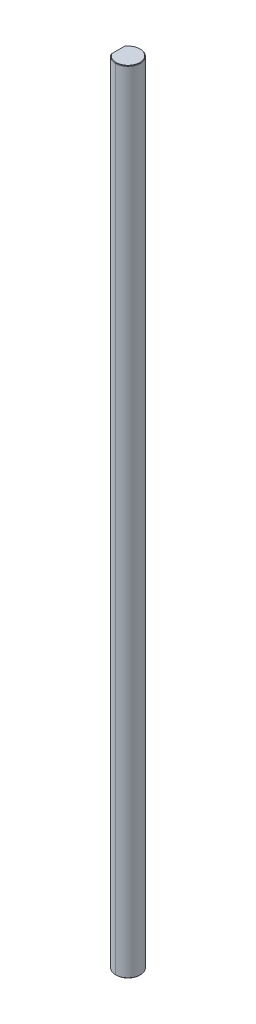
ISO-10303-21;
HEADER;
FILE_DESCRIPTION(('STEP AP214'),'2;1');
FILE_NAME('part.step','',(''),(''),'','','');
FILE_SCHEMA(('AUTOMOTIVE_DESIGN { 1 0 10303 214 1 1 1 1 }'));
ENDSEC;
DATA;
#1=APPLICATION_CONTEXT('core data for automotive mechanical design processes');
#2=APPLICATION_PROTOCOL_DEFINITION('international standard','automotive_design',2000,#1);
#3=PRODUCT_CONTEXT('',#1,'mechanical');
#4=PRODUCT('Part','Part','',(#3));
#5=PRODUCT_RELATED_PRODUCT_CATEGORY('part','',(#4));
#6=PRODUCT_DEFINITION_FORMATION('','',#4);
#7=PRODUCT_DEFINITION_CONTEXT('part definition',#1,'design');
#8=PRODUCT_DEFINITION('design','',#6,#7);
#9=PRODUCT_DEFINITION_SHAPE('','',#8);
#10=(LENGTH_UNIT() NAMED_UNIT(*) SI_UNIT(.MILLI.,.METRE.));
#11=(NAMED_UNIT(*) PLANE_ANGLE_UNIT() SI_UNIT($,.RADIAN.));
#12=(NAMED_UNIT(*) SI_UNIT($,.STERADIAN.) SOLID_ANGLE_UNIT());
#13=UNCERTAINTY_MEASURE_WITH_UNIT(LENGTH_MEASURE(1.E-05),#10,'distance_accuracy_value','');
#14=(GEOMETRIC_REPRESENTATION_CONTEXT(3) GLOBAL_UNCERTAINTY_ASSIGNED_CONTEXT((#13)) GLOBAL_UNIT_ASSIGNED_CONTEXT((#10,
#11,#12)) REPRESENTATION_CONTEXT('',''));
#15=CARTESIAN_POINT('',(0.,0.,0.));
#16=DIRECTION('',(0.,0.,1.));
#17=DIRECTION('',(1.,0.,0.));
#18=AXIS2_PLACEMENT_3D('',#15,#16,#17);
#19=CARTESIAN_POINT('',(0.,203.2,0.));
#20=DIRECTION('',(0.,-1.,0.));
#21=DIRECTION('',(0.,0.,-1.));
#22=AXIS2_PLACEMENT_3D('',#19,#20,#21);
#23=CONICAL_SURFACE('',#22,3.04419,0.785398163397484);
#24=DIRECTION('',(0.,-0.707106781186522,0.707106781186573));
#25=VECTOR('',#24,1.);
#26=CARTESIAN_POINT('',(0.,203.2,3.04419));
#27=LINE('',#26,#25);
#28=CARTESIAN_POINT('',(0.,203.2,3.04419));
#29=VERTEX_POINT('',#28);
#30=CARTESIAN_POINT('',(0.,203.073,3.17119));
#31=VERTEX_POINT('',#30);
#32=EDGE_CURVE('E166',#29,#31,#27,.T.);
#33=ORIENTED_EDGE('',*,*,#32,.F.);
#34=CARTESIAN_POINT('',(0.,203.2,0.));
#35=DIRECTION('',(0.,1.,0.));
#36=DIRECTION('',(0.,0.,1.));
#37=AXIS2_PLACEMENT_3D('',#34,#35,#36);
#38=CIRCLE('',#37,3.04419);
#39=CARTESIAN_POINT('',(-2.54381,203.2,1.67216130800824));
#40=VERTEX_POINT('',#39);
#41=EDGE_CURVE('E29',#40,#29,#38,.T.);
#42=ORIENTED_EDGE('',*,*,#41,.F.);
#43=CARTESIAN_POINT('',(-2.54381,203.073,1.89353550270387));
#44=CARTESIAN_POINT('',(-2.54381,203.116613746444,1.82049357854219));
#45=CARTESIAN_POINT('',(-2.54381,203.159042414268,1.74672509100728));
#46=CARTESIAN_POINT('',(-2.54381,203.2,1.67216130800824));
#47=(BOUNDED_CURVE() B_SPLINE_CURVE(3,(#43,#44,#45,#46),.UNSPECIFIED.,.F.,
.F.) B_SPLINE_CURVE_WITH_KNOTS((4,4),(0.,0.000255216641458076),
.UNSPECIFIED.) CURVE() GEOMETRIC_REPRESENTATION_ITEM() RATIONAL_B_SPLINE_CURVE((1.,1.,1.,1.)) REPRESENTATION_ITEM(''));
#48=CARTESIAN_POINT('',(-2.54381,203.073,1.89353550270387));
#49=VERTEX_POINT('',#48);
#50=EDGE_CURVE('E193',#49,#40,#47,.T.);
#51=ORIENTED_EDGE('',*,*,#50,.F.);
#52=CARTESIAN_POINT('',(0.,203.073,0.));
#53=DIRECTION('',(0.,-1.,0.));
#54=DIRECTION('',(0.,0.,1.));
#55=AXIS2_PLACEMENT_3D('',#52,#53,#54);
#56=CIRCLE('',#55,3.17119);
#57=EDGE_CURVE('E60',#31,#49,#56,.T.);
#58=ORIENTED_EDGE('',*,*,#57,.F.);
#59=EDGE_LOOP('',(#33,#42,#51,#58));
#60=FACE_BOUND('',#59,.T.);
#61=ADVANCED_FACE('F16',(#60),#23,.T.);
#62=CARTESIAN_POINT('',(0.,0.127000000000044,0.));
#63=DIRECTION('',(0.,1.,0.));
#64=DIRECTION('',(0.,0.,1.));
#65=AXIS2_PLACEMENT_3D('',#62,#63,#64);
#66=CONICAL_SURFACE('',#65,3.17119,0.785398163397376);
#67=DIRECTION('',(0.,0.707106781186599,-0.707106781186496));
#68=VECTOR('',#67,1.);
#69=CARTESIAN_POINT('',(0.,0.127000000000044,-3.17119));
#70=LINE('',#69,#68);
#71=CARTESIAN_POINT('',(0.,0.,-3.04419));
#72=VERTEX_POINT('',#71);
#73=CARTESIAN_POINT('',(0.,0.127000000000044,-3.17119));
#74=VERTEX_POINT('',#73);
#75=EDGE_CURVE('E151',#72,#74,#70,.T.);
#76=ORIENTED_EDGE('',*,*,#75,.F.);
#77=CARTESIAN_POINT('',(0.,0.,0.));
#78=DIRECTION('',(0.,-1.,0.));
#79=DIRECTION('',(0.,0.,1.));
#80=AXIS2_PLACEMENT_3D('',#77,#78,#79);
#81=CIRCLE('',#80,3.04419);
#82=CARTESIAN_POINT('',(-2.54381,0.,-1.67216130800824));
#83=VERTEX_POINT('',#82);
#84=EDGE_CURVE('E11',#83,#72,#81,.T.);
#85=ORIENTED_EDGE('',*,*,#84,.F.);
#86=CARTESIAN_POINT('',(-2.54381,0.127000000000044,-1.89353550270387));
#87=CARTESIAN_POINT('',(-2.54381,0.0833862535559772,-1.82049357854219));
#88=CARTESIAN_POINT('',(-2.54381,0.0409575857320699,-1.74672509100728));
#89=CARTESIAN_POINT('',(-2.54381,0.,-1.67216130800824));
#90=(BOUNDED_CURVE() B_SPLINE_CURVE(3,(#86,#87,#88,#89),.UNSPECIFIED.,.F.,
.F.) B_SPLINE_CURVE_WITH_KNOTS((4,4),(0.,0.00025521664145809),
.UNSPECIFIED.) CURVE() GEOMETRIC_REPRESENTATION_ITEM() RATIONAL_B_SPLINE_CURVE((1.,1.,1.,1.)) REPRESENTATION_ITEM(''));
#91=CARTESIAN_POINT('',(-2.54381,0.127000000000044,-1.89353550270387));
#92=VERTEX_POINT('',#91);
#93=EDGE_CURVE('E175',#92,#83,#90,.T.);
#94=ORIENTED_EDGE('',*,*,#93,.F.);
#95=CARTESIAN_POINT('',(0.,0.127000000000044,0.));
#96=DIRECTION('',(0.,1.,0.));
#97=DIRECTION('',(0.,0.,1.));
#98=AXIS2_PLACEMENT_3D('',#95,#96,#97);
#99=CIRCLE('',#98,3.17119);
#100=EDGE_CURVE('E171',#74,#92,#99,.T.);
#101=ORIENTED_EDGE('',*,*,#100,.F.);
#102=EDGE_LOOP('',(#76,#85,#94,#101));
#103=FACE_BOUND('',#102,.T.);
#104=ADVANCED_FACE('F239',(#103),#66,.T.);
#105=CARTESIAN_POINT('',(0.,0.,0.));
#106=DIRECTION('',(0.,1.,0.));
#107=DIRECTION('',(1.,0.,0.));
#108=AXIS2_PLACEMENT_3D('',#105,#106,#107);
#109=PLANE('',#108);
#110=DIRECTION('',(0.,0.,1.));
#111=VECTOR('',#110,1.);
#112=CARTESIAN_POINT('',(-2.54381,0.,-1.89353550270387));
#113=LINE('',#112,#111);
#114=CARTESIAN_POINT('',(-2.54381,0.,1.67216130800824));
#115=VERTEX_POINT('',#114);
#116=EDGE_CURVE('E96',#83,#115,#113,.T.);
#117=ORIENTED_EDGE('',*,*,#116,.F.);
#118=ORIENTED_EDGE('',*,*,#84,.T.);
#119=CARTESIAN_POINT('',(0.,0.,0.));
#120=DIRECTION('',(0.,-1.,0.));
#121=DIRECTION('',(0.,0.,1.));
#122=AXIS2_PLACEMENT_3D('',#119,#120,#121);
#123=CIRCLE('',#122,3.04419);
#124=CARTESIAN_POINT('',(0.,0.,3.04419));
#125=VERTEX_POINT('',#124);
#126=EDGE_CURVE('E145',#72,#125,#123,.T.);
#127=ORIENTED_EDGE('',*,*,#126,.T.);
#128=CARTESIAN_POINT('',(0.,0.,0.));
#129=DIRECTION('',(0.,-1.,0.));
#130=DIRECTION('',(0.,0.,1.));
#131=AXIS2_PLACEMENT_3D('',#128,#129,#130);
#132=CIRCLE('',#131,3.04419);
#133=EDGE_CURVE('E132',#125,#115,#132,.T.);
#134=ORIENTED_EDGE('',*,*,#133,.T.);
#135=EDGE_LOOP('',(#117,#118,#127,#134));
#136=FACE_BOUND('',#135,.T.);
#137=ADVANCED_FACE('F149',(#136),#109,.F.);
#138=CARTESIAN_POINT('',(0.,203.2,0.));
#139=DIRECTION('',(0.,1.,0.));
#140=DIRECTION('',(1.,0.,0.));
#141=AXIS2_PLACEMENT_3D('',#138,#139,#140);
#142=PLANE('',#141);
#143=DIRECTION('',(0.,0.,1.));
#144=VECTOR('',#143,1.);
#145=CARTESIAN_POINT('',(-2.54381,203.2,-1.89353550270387));
#146=LINE('',#145,#144);
#147=CARTESIAN_POINT('',(-2.54381,203.2,-1.67216130800824));
#148=VERTEX_POINT('',#147);
#149=EDGE_CURVE('E184',#148,#40,#146,.T.);
#150=ORIENTED_EDGE('',*,*,#149,.T.);
#151=ORIENTED_EDGE('',*,*,#41,.T.);
#152=CARTESIAN_POINT('',(0.,203.2,0.));
#153=DIRECTION('',(0.,1.,0.));
#154=DIRECTION('',(0.,0.,1.));
#155=AXIS2_PLACEMENT_3D('',#152,#153,#154);
#156=CIRCLE('',#155,3.04419);
#157=CARTESIAN_POINT('',(0.,203.2,-3.04419));
#158=VERTEX_POINT('',#157);
#159=EDGE_CURVE('E163',#29,#158,#156,.T.);
#160=ORIENTED_EDGE('',*,*,#159,.T.);
#161=CARTESIAN_POINT('',(0.,203.2,0.));
#162=DIRECTION('',(0.,1.,0.));
#163=DIRECTION('',(0.,0.,1.));
#164=AXIS2_PLACEMENT_3D('',#161,#162,#163);
#165=CIRCLE('',#164,3.04419);
#166=EDGE_CURVE('E78',#158,#148,#165,.T.);
#167=ORIENTED_EDGE('',*,*,#166,.T.);
#168=EDGE_LOOP('',(#150,#151,#160,#167));
#169=FACE_BOUND('',#168,.T.);
#170=ADVANCED_FACE('F249',(#169),#142,.T.);
#171=CARTESIAN_POINT('',(-2.54381,203.2,-1.89353550270387));
#172=DIRECTION('',(1.,0.,0.));
#173=DIRECTION('',(0.,1.,0.));
#174=AXIS2_PLACEMENT_3D('',#171,#172,#173);
#175=PLANE('',#174);
#176=DIRECTION('',(0.,-1.,0.));
#177=VECTOR('',#176,1.);
#178=CARTESIAN_POINT('',(-2.54381,203.2,-1.89353550270387));
#179=LINE('',#178,#177);
#180=CARTESIAN_POINT('',(-2.54381,203.073,-1.89353550270387));
#181=VERTEX_POINT('',#180);
#182=EDGE_CURVE('E167',#181,#92,#179,.T.);
#183=ORIENTED_EDGE('',*,*,#182,.T.);
#184=ORIENTED_EDGE('',*,*,#93,.T.);
#185=ORIENTED_EDGE('',*,*,#116,.T.);
#186=CARTESIAN_POINT('',(-2.54381,0.,1.67216130800824));
#187=CARTESIAN_POINT('',(-2.54381,0.040957585732076,1.74672509100728));
#188=CARTESIAN_POINT('',(-2.54381,0.0833862535559736,1.82049357854219));
#189=CARTESIAN_POINT('',(-2.54381,0.127000000000044,1.89353550270387));
#190=(BOUNDED_CURVE() B_SPLINE_CURVE(3,(#186,#187,#188,#189),.UNSPECIFIED.,.F.,
.F.) B_SPLINE_CURVE_WITH_KNOTS((4,4),(0.,0.00025521664145809),
.UNSPECIFIED.) CURVE() GEOMETRIC_REPRESENTATION_ITEM() RATIONAL_B_SPLINE_CURVE((1.,1.,1.,1.)) REPRESENTATION_ITEM(''));
#191=CARTESIAN_POINT('',(-2.54381,0.127000000000044,1.89353550270387));
#192=VERTEX_POINT('',#191);
#193=EDGE_CURVE('E20',#115,#192,#190,.T.);
#194=ORIENTED_EDGE('',*,*,#193,.T.);
#195=DIRECTION('',(0.,-1.,0.));
#196=VECTOR('',#195,1.);
#197=CARTESIAN_POINT('',(-2.54381,203.2,1.89353550270387));
#198=LINE('',#197,#196);
#199=EDGE_CURVE('E172',#49,#192,#198,.T.);
#200=ORIENTED_EDGE('',*,*,#199,.F.);
#201=ORIENTED_EDGE('',*,*,#50,.T.);
#202=ORIENTED_EDGE('',*,*,#149,.F.);
#203=CARTESIAN_POINT('',(-2.54381,203.2,-1.67216130800824));
#204=CARTESIAN_POINT('',(-2.54381,203.159042414268,-1.74672509100728));
#205=CARTESIAN_POINT('',(-2.54381,203.116613746444,-1.82049357854219));
#206=CARTESIAN_POINT('',(-2.54381,203.073,-1.89353550270387));
#207=(BOUNDED_CURVE() B_SPLINE_CURVE(3,(#203,#204,#205,#206),.UNSPECIFIED.,.F.,
.F.) B_SPLINE_CURVE_WITH_KNOTS((4,4),(0.,0.000255216641458076),
.UNSPECIFIED.) CURVE() GEOMETRIC_REPRESENTATION_ITEM() RATIONAL_B_SPLINE_CURVE((1.,1.,1.,1.)) REPRESENTATION_ITEM(''));
#208=EDGE_CURVE('E152',#148,#181,#207,.T.);
#209=ORIENTED_EDGE('',*,*,#208,.T.);
#210=EDGE_LOOP('',(#183,#184,#185,#194,#200,#201,#202,#209));
#211=FACE_BOUND('',#210,.T.);
#212=ADVANCED_FACE('F262',(#211),#175,.F.);
#213=CARTESIAN_POINT('',(0.,203.2,0.));
#214=DIRECTION('',(0.,-1.,0.));
#215=DIRECTION('',(0.,0.,-1.));
#216=AXIS2_PLACEMENT_3D('',#213,#214,#215);
#217=CYLINDRICAL_SURFACE('',#216,3.17119);
#218=DIRECTION('',(0.,-1.,0.));
#219=VECTOR('',#218,1.);
#220=CARTESIAN_POINT('',(0.,203.2,3.17119));
#221=LINE('',#220,#219);
#222=CARTESIAN_POINT('',(0.,0.127000000000044,3.17119));
#223=VERTEX_POINT('',#222);
#224=EDGE_CURVE('E110',#31,#223,#221,.T.);
#225=ORIENTED_EDGE('',*,*,#224,.F.);
#226=ORIENTED_EDGE('',*,*,#57,.T.);
#227=ORIENTED_EDGE('',*,*,#199,.T.);
#228=CARTESIAN_POINT('',(0.,0.127000000000044,0.));
#229=DIRECTION('',(0.,1.,0.));
#230=DIRECTION('',(0.,0.,1.));
#231=AXIS2_PLACEMENT_3D('',#228,#229,#230);
#232=CIRCLE('',#231,3.17119);
#233=EDGE_CURVE('E139',#192,#223,#232,.T.);
#234=ORIENTED_EDGE('',*,*,#233,.T.);
#235=EDGE_LOOP('',(#225,#226,#227,#234));
#236=FACE_BOUND('',#235,.T.);
#237=ADVANCED_FACE('F258',(#236),#217,.T.);
#238=CARTESIAN_POINT('',(0.,203.2,0.));
#239=DIRECTION('',(0.,-1.,0.));
#240=DIRECTION('',(0.,0.,-1.));
#241=AXIS2_PLACEMENT_3D('',#238,#239,#240);
#242=CYLINDRICAL_SURFACE('',#241,3.17119);
#243=CARTESIAN_POINT('',(0.,203.073,0.));
#244=DIRECTION('',(0.,-1.,0.));
#245=DIRECTION('',(0.,0.,1.));
#246=AXIS2_PLACEMENT_3D('',#243,#244,#245);
#247=CIRCLE('',#246,3.17119);
#248=CARTESIAN_POINT('',(0.,203.073,-3.17119));
#249=VERTEX_POINT('',#248);
#250=EDGE_CURVE('E160',#181,#249,#247,.T.);
#251=ORIENTED_EDGE('',*,*,#250,.T.);
#252=DIRECTION('',(0.,-1.,0.));
#253=VECTOR('',#252,1.);
#254=CARTESIAN_POINT('',(0.,203.2,-3.17119));
#255=LINE('',#254,#253);
#256=EDGE_CURVE('E176',#249,#74,#255,.T.);
#257=ORIENTED_EDGE('',*,*,#256,.T.);
#258=ORIENTED_EDGE('',*,*,#100,.T.);
#259=ORIENTED_EDGE('',*,*,#182,.F.);
#260=EDGE_LOOP('',(#251,#257,#258,#259));
#261=FACE_BOUND('',#260,.T.);
#262=ADVANCED_FACE('F255',(#261),#242,.T.);
#263=CARTESIAN_POINT('',(0.,203.2,0.));
#264=DIRECTION('',(0.,-1.,0.));
#265=DIRECTION('',(0.,0.,-1.));
#266=AXIS2_PLACEMENT_3D('',#263,#264,#265);
#267=CYLINDRICAL_SURFACE('',#266,3.17119);
#268=CARTESIAN_POINT('',(0.,203.073,0.));
#269=DIRECTION('',(0.,-1.,0.));
#270=DIRECTION('',(0.,0.,1.));
#271=AXIS2_PLACEMENT_3D('',#268,#269,#270);
#272=CIRCLE('',#271,3.17119);
#273=EDGE_CURVE('E212',#249,#31,#272,.T.);
#274=ORIENTED_EDGE('',*,*,#273,.T.);
#275=ORIENTED_EDGE('',*,*,#224,.T.);
#276=CARTESIAN_POINT('',(0.,0.127000000000044,0.));
#277=DIRECTION('',(0.,1.,0.));
#278=DIRECTION('',(0.,0.,1.));
#279=AXIS2_PLACEMENT_3D('',#276,#277,#278);
#280=CIRCLE('',#279,3.17119);
#281=EDGE_CURVE('E146',#223,#74,#280,.T.);
#282=ORIENTED_EDGE('',*,*,#281,.T.);
#283=ORIENTED_EDGE('',*,*,#256,.F.);
#284=EDGE_LOOP('',(#274,#275,#282,#283));
#285=FACE_BOUND('',#284,.T.);
#286=ADVANCED_FACE('F18',(#285),#267,.T.);
#287=CARTESIAN_POINT('',(0.,0.127000000000044,0.));
#288=DIRECTION('',(0.,1.,0.));
#289=DIRECTION('',(0.,0.,1.));
#290=AXIS2_PLACEMENT_3D('',#287,#288,#289);
#291=CONICAL_SURFACE('',#290,3.17119,0.785398163397376);
#292=ORIENTED_EDGE('',*,*,#133,.F.);
#293=DIRECTION('',(0.,0.707106781186599,0.707106781186496));
#294=VECTOR('',#293,1.);
#295=CARTESIAN_POINT('',(0.,0.127000000000044,3.17119));
#296=LINE('',#295,#294);
#297=EDGE_CURVE('E136',#125,#223,#296,.T.);
#298=ORIENTED_EDGE('',*,*,#297,.T.);
#299=ORIENTED_EDGE('',*,*,#233,.F.);
#300=ORIENTED_EDGE('',*,*,#193,.F.);
#301=EDGE_LOOP('',(#292,#298,#299,#300));
#302=FACE_BOUND('',#301,.T.);
#303=ADVANCED_FACE('F134',(#302),#291,.T.);
#304=CARTESIAN_POINT('',(0.,0.127000000000044,0.));
#305=DIRECTION('',(0.,1.,0.));
#306=DIRECTION('',(0.,0.,1.));
#307=AXIS2_PLACEMENT_3D('',#304,#305,#306);
#308=CONICAL_SURFACE('',#307,3.17119,0.785398163397376);
#309=ORIENTED_EDGE('',*,*,#126,.F.);
#310=ORIENTED_EDGE('',*,*,#75,.T.);
#311=ORIENTED_EDGE('',*,*,#281,.F.);
#312=ORIENTED_EDGE('',*,*,#297,.F.);
#313=EDGE_LOOP('',(#309,#310,#311,#312));
#314=FACE_BOUND('',#313,.T.);
#315=ADVANCED_FACE('F143',(#314),#308,.T.);
#316=CARTESIAN_POINT('',(0.,203.2,0.));
#317=DIRECTION('',(0.,-1.,0.));
#318=DIRECTION('',(0.,0.,-1.));
#319=AXIS2_PLACEMENT_3D('',#316,#317,#318);
#320=CONICAL_SURFACE('',#319,3.04419,0.785398163397484);
#321=ORIENTED_EDGE('',*,*,#166,.F.);
#322=DIRECTION('',(0.,-0.707106781186522,-0.707106781186573));
#323=VECTOR('',#322,1.);
#324=CARTESIAN_POINT('',(0.,203.2,-3.04419));
#325=LINE('',#324,#323);
#326=EDGE_CURVE('E196',#158,#249,#325,.T.);
#327=ORIENTED_EDGE('',*,*,#326,.T.);
#328=ORIENTED_EDGE('',*,*,#250,.F.);
#329=ORIENTED_EDGE('',*,*,#208,.F.);
#330=EDGE_LOOP('',(#321,#327,#328,#329));
#331=FACE_BOUND('',#330,.T.);
#332=ADVANCED_FACE('F261',(#331),#320,.T.);
#333=CARTESIAN_POINT('',(0.,203.2,0.));
#334=DIRECTION('',(0.,-1.,0.));
#335=DIRECTION('',(0.,0.,-1.));
#336=AXIS2_PLACEMENT_3D('',#333,#334,#335);
#337=CONICAL_SURFACE('',#336,3.04419,0.785398163397484);
#338=ORIENTED_EDGE('',*,*,#159,.F.);
#339=ORIENTED_EDGE('',*,*,#32,.T.);
#340=ORIENTED_EDGE('',*,*,#273,.F.);
#341=ORIENTED_EDGE('',*,*,#326,.F.);
#342=EDGE_LOOP('',(#338,#339,#340,#341));
#343=FACE_BOUND('',#342,.T.);
#344=ADVANCED_FACE('F237',(#343),#337,.T.);
#345=CLOSED_SHELL('',(#61,#104,#137,#170,#212,#237,#262,#286,#303,#315,#332,#344));
#346=MANIFOLD_SOLID_BREP('B1',#345);
#347=ADVANCED_BREP_SHAPE_REPRESENTATION('',(#18,#346),#14);
#348=SHAPE_DEFINITION_REPRESENTATION(#9,#347);
ENDSEC;
END-ISO-10303-21;
